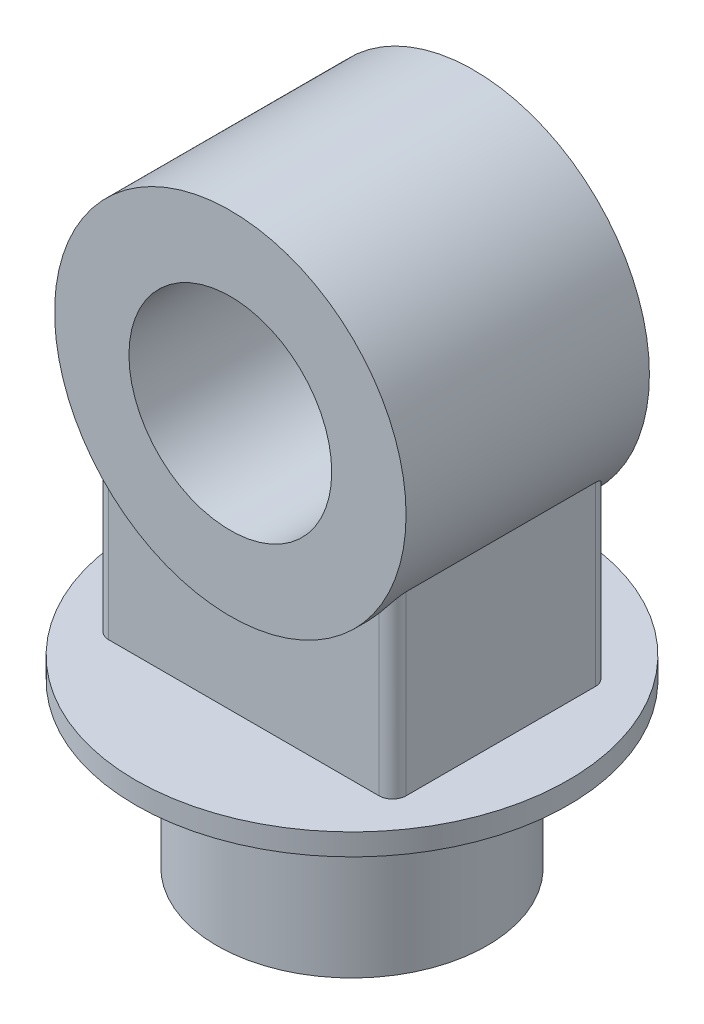
ISO-10303-21;
HEADER;
FILE_DESCRIPTION(('STEP AP214'),'2;1');
FILE_NAME('part.step','',(''),(''),'','','');
FILE_SCHEMA(('AUTOMOTIVE_DESIGN { 1 0 10303 214 1 1 1 1 }'));
ENDSEC;
DATA;
#1=APPLICATION_CONTEXT('core data for automotive mechanical design processes');
#2=APPLICATION_PROTOCOL_DEFINITION('international standard','automotive_design',2000,#1);
#3=PRODUCT_CONTEXT('',#1,'mechanical');
#4=PRODUCT('Part','Part','',(#3));
#5=PRODUCT_RELATED_PRODUCT_CATEGORY('part','',(#4));
#6=PRODUCT_DEFINITION_FORMATION('','',#4);
#7=PRODUCT_DEFINITION_CONTEXT('part definition',#1,'design');
#8=PRODUCT_DEFINITION('design','',#6,#7);
#9=PRODUCT_DEFINITION_SHAPE('','',#8);
#10=(LENGTH_UNIT() NAMED_UNIT(*) SI_UNIT(.MILLI.,.METRE.));
#11=(NAMED_UNIT(*) PLANE_ANGLE_UNIT() SI_UNIT($,.RADIAN.));
#12=(NAMED_UNIT(*) SI_UNIT($,.STERADIAN.) SOLID_ANGLE_UNIT());
#13=UNCERTAINTY_MEASURE_WITH_UNIT(LENGTH_MEASURE(1.E-05),#10,'distance_accuracy_value','');
#14=(GEOMETRIC_REPRESENTATION_CONTEXT(3) GLOBAL_UNCERTAINTY_ASSIGNED_CONTEXT((#13)) GLOBAL_UNIT_ASSIGNED_CONTEXT((#10,
#11,#12)) REPRESENTATION_CONTEXT('',''));
#15=CARTESIAN_POINT('',(0.,0.,0.));
#16=DIRECTION('',(0.,0.,1.));
#17=DIRECTION('',(1.,0.,0.));
#18=AXIS2_PLACEMENT_3D('',#15,#16,#17);
#19=CARTESIAN_POINT('',(0.,120.,0.));
#20=DIRECTION('',(0.,-1.,0.));
#21=DIRECTION('',(0.,0.,-1.));
#22=AXIS2_PLACEMENT_3D('',#19,#20,#21);
#23=CYLINDRICAL_SURFACE('',#22,100.);
#24=CARTESIAN_POINT('',(0.,120.,0.));
#25=DIRECTION('',(0.,1.,0.));
#26=DIRECTION('',(0.,0.,1.));
#27=AXIS2_PLACEMENT_3D('',#24,#25,#26);
#28=CIRCLE('',#27,100.);
#29=CARTESIAN_POINT('',(0.,120.,100.));
#30=VERTEX_POINT('',#29);
#31=EDGE_CURVE('E146',#30,#30,#28,.T.);
#32=ORIENTED_EDGE('',*,*,#31,.F.);
#33=EDGE_LOOP('',(#32));
#34=FACE_BOUND('',#33,.T.);
#35=CARTESIAN_POINT('',(0.,0.,0.));
#36=DIRECTION('',(0.,1.,0.));
#37=DIRECTION('',(0.,0.,1.));
#38=AXIS2_PLACEMENT_3D('',#35,#36,#37);
#39=CIRCLE('',#38,100.);
#40=CARTESIAN_POINT('',(0.,0.,100.));
#41=VERTEX_POINT('',#40);
#42=EDGE_CURVE('E240',#41,#41,#39,.T.);
#43=ORIENTED_EDGE('',*,*,#42,.T.);
#44=EDGE_LOOP('',(#43));
#45=FACE_BOUND('',#44,.T.);
#46=ADVANCED_FACE('F39',(#34,#45),#23,.T.);
#47=CARTESIAN_POINT('',(0.,0.,0.));
#48=DIRECTION('',(0.,1.,0.));
#49=DIRECTION('',(0.,0.,1.));
#50=AXIS2_PLACEMENT_3D('',#47,#48,#49);
#51=PLANE('',#50);
#52=ORIENTED_EDGE('',*,*,#42,.F.);
#53=EDGE_LOOP('',(#52));
#54=FACE_BOUND('',#53,.T.);
#55=ADVANCED_FACE('F251',(#54),#51,.F.);
#56=CARTESIAN_POINT('',(0.,136.,0.));
#57=DIRECTION('',(0.,-1.,0.));
#58=DIRECTION('',(0.,0.,-1.));
#59=AXIS2_PLACEMENT_3D('',#56,#57,#58);
#60=CYLINDRICAL_SURFACE('',#59,160.);
#61=CARTESIAN_POINT('',(0.,136.,0.));
#62=DIRECTION('',(0.,1.,0.));
#63=DIRECTION('',(0.,0.,1.));
#64=AXIS2_PLACEMENT_3D('',#61,#62,#63);
#65=CIRCLE('',#64,160.);
#66=CARTESIAN_POINT('',(0.,136.,160.));
#67=VERTEX_POINT('',#66);
#68=EDGE_CURVE('E236',#67,#67,#65,.T.);
#69=ORIENTED_EDGE('',*,*,#68,.F.);
#70=EDGE_LOOP('',(#69));
#71=FACE_BOUND('',#70,.T.);
#72=CARTESIAN_POINT('',(0.,120.,0.));
#73=DIRECTION('',(0.,1.,0.));
#74=DIRECTION('',(0.,0.,1.));
#75=AXIS2_PLACEMENT_3D('',#72,#73,#74);
#76=CIRCLE('',#75,160.);
#77=CARTESIAN_POINT('',(0.,120.,160.));
#78=VERTEX_POINT('',#77);
#79=EDGE_CURVE('E216',#78,#78,#76,.T.);
#80=ORIENTED_EDGE('',*,*,#79,.T.);
#81=EDGE_LOOP('',(#80));
#82=FACE_BOUND('',#81,.T.);
#83=ADVANCED_FACE('F253',(#71,#82),#60,.T.);
#84=CARTESIAN_POINT('',(0.,136.,0.));
#85=DIRECTION('',(0.,1.,0.));
#86=DIRECTION('',(0.,0.,1.));
#87=AXIS2_PLACEMENT_3D('',#84,#85,#86);
#88=PLANE('',#87);
#89=DIRECTION('',(0.,0.,-1.));
#90=VECTOR('',#89,1.);
#91=CARTESIAN_POINT('',(110.,136.,80.));
#92=LINE('',#91,#90);
#93=CARTESIAN_POINT('',(110.,136.,70.));
#94=VERTEX_POINT('',#93);
#95=CARTESIAN_POINT('',(110.,136.,-70.));
#96=VERTEX_POINT('',#95);
#97=EDGE_CURVE('E208',#94,#96,#92,.T.);
#98=ORIENTED_EDGE('',*,*,#97,.F.);
#99=CARTESIAN_POINT('',(100.,136.,70.));
#100=DIRECTION('',(0.,1.,0.));
#101=DIRECTION('',(0.,0.,1.));
#102=AXIS2_PLACEMENT_3D('',#99,#100,#101);
#103=CIRCLE('',#102,10.);
#104=CARTESIAN_POINT('',(100.,136.,80.));
#105=VERTEX_POINT('',#104);
#106=EDGE_CURVE('E123',#94,#105,#103,.F.);
#107=ORIENTED_EDGE('',*,*,#106,.T.);
#108=DIRECTION('',(1.,0.,0.));
#109=VECTOR('',#108,1.);
#110=CARTESIAN_POINT('',(-110.,136.,80.));
#111=LINE('',#110,#109);
#112=CARTESIAN_POINT('',(-100.,136.,80.));
#113=VERTEX_POINT('',#112);
#114=EDGE_CURVE('E231',#113,#105,#111,.T.);
#115=ORIENTED_EDGE('',*,*,#114,.F.);
#116=CARTESIAN_POINT('',(-100.,136.,70.));
#117=DIRECTION('',(0.,1.,0.));
#118=DIRECTION('',(0.,0.,1.));
#119=AXIS2_PLACEMENT_3D('',#116,#117,#118);
#120=CIRCLE('',#119,10.);
#121=CARTESIAN_POINT('',(-110.,136.,70.));
#122=VERTEX_POINT('',#121);
#123=EDGE_CURVE('E124',#113,#122,#120,.F.);
#124=ORIENTED_EDGE('',*,*,#123,.T.);
#125=DIRECTION('',(0.,0.,1.));
#126=VECTOR('',#125,1.);
#127=CARTESIAN_POINT('',(-110.,136.,80.));
#128=LINE('',#127,#126);
#129=CARTESIAN_POINT('',(-110.,136.,-70.));
#130=VERTEX_POINT('',#129);
#131=EDGE_CURVE('E393',#130,#122,#128,.T.);
#132=ORIENTED_EDGE('',*,*,#131,.F.);
#133=CARTESIAN_POINT('',(-100.,136.,-70.));
#134=DIRECTION('',(0.,1.,0.));
#135=DIRECTION('',(0.,0.,1.));
#136=AXIS2_PLACEMENT_3D('',#133,#134,#135);
#137=CIRCLE('',#136,10.);
#138=CARTESIAN_POINT('',(-100.,136.,-80.));
#139=VERTEX_POINT('',#138);
#140=EDGE_CURVE('E61',#130,#139,#137,.F.);
#141=ORIENTED_EDGE('',*,*,#140,.T.);
#142=DIRECTION('',(-1.,0.,0.));
#143=VECTOR('',#142,1.);
#144=CARTESIAN_POINT('',(-110.,136.,-80.));
#145=LINE('',#144,#143);
#146=CARTESIAN_POINT('',(100.,136.,-80.));
#147=VERTEX_POINT('',#146);
#148=EDGE_CURVE('E209',#147,#139,#145,.T.);
#149=ORIENTED_EDGE('',*,*,#148,.F.);
#150=CARTESIAN_POINT('',(100.,136.,-70.));
#151=DIRECTION('',(0.,1.,0.));
#152=DIRECTION('',(0.,0.,1.));
#153=AXIS2_PLACEMENT_3D('',#150,#151,#152);
#154=CIRCLE('',#153,10.);
#155=EDGE_CURVE('E54',#147,#96,#154,.F.);
#156=ORIENTED_EDGE('',*,*,#155,.T.);
#157=EDGE_LOOP('',(#98,#107,#115,#124,#132,#141,#149,#156));
#158=FACE_BOUND('',#157,.T.);
#159=ORIENTED_EDGE('',*,*,#68,.T.);
#160=EDGE_LOOP('',(#159));
#161=FACE_BOUND('',#160,.T.);
#162=ADVANCED_FACE('F206',(#158,#161),#88,.T.);
#163=CARTESIAN_POINT('',(0.,120.,0.));
#164=DIRECTION('',(0.,1.,0.));
#165=DIRECTION('',(0.,0.,1.));
#166=AXIS2_PLACEMENT_3D('',#163,#164,#165);
#167=PLANE('',#166);
#168=ORIENTED_EDGE('',*,*,#31,.T.);
#169=EDGE_LOOP('',(#168));
#170=FACE_BOUND('',#169,.T.);
#171=ORIENTED_EDGE('',*,*,#79,.F.);
#172=EDGE_LOOP('',(#171));
#173=FACE_BOUND('',#172,.T.);
#174=ADVANCED_FACE('F262',(#170,#173),#167,.F.);
#175=CARTESIAN_POINT('',(-110.,466.002,-80.));
#176=DIRECTION('',(0.,0.,1.));
#177=DIRECTION('',(1.,0.,0.));
#178=AXIS2_PLACEMENT_3D('',#175,#176,#177);
#179=PLANE('',#178);
#180=ORIENTED_EDGE('',*,*,#148,.T.);
#181=DIRECTION('',(0.,-1.,0.));
#182=VECTOR('',#181,1.);
#183=CARTESIAN_POINT('',(-100.,466.002,-80.));
#184=LINE('',#183,#182);
#185=CARTESIAN_POINT('',(-100.,252.933761370819,-80.));
#186=VERTEX_POINT('',#185);
#187=EDGE_CURVE('E162',#139,#186,#184,.F.);
#188=ORIENTED_EDGE('',*,*,#187,.T.);
#189=CARTESIAN_POINT('',(0.,336.,-80.));
#190=DIRECTION('',(0.,0.,1.));
#191=DIRECTION('',(1.,0.,0.));
#192=AXIS2_PLACEMENT_3D('',#189,#190,#191);
#193=CIRCLE('',#192,130.);
#194=CARTESIAN_POINT('',(100.,252.933761370819,-80.));
#195=VERTEX_POINT('',#194);
#196=EDGE_CURVE('E221',#195,#186,#193,.F.);
#197=ORIENTED_EDGE('',*,*,#196,.F.);
#198=DIRECTION('',(0.,-1.,0.));
#199=VECTOR('',#198,1.);
#200=CARTESIAN_POINT('',(100.,466.002,-80.));
#201=LINE('',#200,#199);
#202=EDGE_CURVE('E159',#195,#147,#201,.T.);
#203=ORIENTED_EDGE('',*,*,#202,.T.);
#204=EDGE_LOOP('',(#180,#188,#197,#203));
#205=FACE_BOUND('',#204,.T.);
#206=ADVANCED_FACE('F225',(#205),#179,.F.);
#207=CARTESIAN_POINT('',(110.,466.002,80.));
#208=DIRECTION('',(-1.,0.,0.));
#209=DIRECTION('',(0.,0.,1.));
#210=AXIS2_PLACEMENT_3D('',#207,#208,#209);
#211=PLANE('',#210);
#212=DIRECTION('',(0.,0.,-1.));
#213=VECTOR('',#212,1.);
#214=CARTESIAN_POINT('',(110.,266.717967697245,90.));
#215=LINE('',#214,#213);
#216=CARTESIAN_POINT('',(110.,266.717967697245,70.));
#217=VERTEX_POINT('',#216);
#218=CARTESIAN_POINT('',(110.,266.717967697245,-70.));
#219=VERTEX_POINT('',#218);
#220=EDGE_CURVE('E223',#217,#219,#215,.T.);
#221=ORIENTED_EDGE('',*,*,#220,.F.);
#222=DIRECTION('',(0.,-1.,0.));
#223=VECTOR('',#222,1.);
#224=CARTESIAN_POINT('',(110.,466.002,70.));
#225=LINE('',#224,#223);
#226=EDGE_CURVE('E155',#217,#94,#225,.T.);
#227=ORIENTED_EDGE('',*,*,#226,.T.);
#228=ORIENTED_EDGE('',*,*,#97,.T.);
#229=DIRECTION('',(0.,-1.,0.));
#230=VECTOR('',#229,1.);
#231=CARTESIAN_POINT('',(110.,466.002,-70.));
#232=LINE('',#231,#230);
#233=EDGE_CURVE('E152',#96,#219,#232,.F.);
#234=ORIENTED_EDGE('',*,*,#233,.T.);
#235=EDGE_LOOP('',(#221,#227,#228,#234));
#236=FACE_BOUND('',#235,.T.);
#237=ADVANCED_FACE('F212',(#236),#211,.F.);
#238=CARTESIAN_POINT('',(-110.,466.002,80.));
#239=DIRECTION('',(1.,0.,0.));
#240=DIRECTION('',(0.,0.,-1.));
#241=AXIS2_PLACEMENT_3D('',#238,#239,#240);
#242=PLANE('',#241);
#243=ORIENTED_EDGE('',*,*,#131,.T.);
#244=DIRECTION('',(0.,-1.,0.));
#245=VECTOR('',#244,1.);
#246=CARTESIAN_POINT('',(-110.,466.002,70.));
#247=LINE('',#246,#245);
#248=CARTESIAN_POINT('',(-110.,266.717967697245,70.));
#249=VERTEX_POINT('',#248);
#250=EDGE_CURVE('E144',#122,#249,#247,.F.);
#251=ORIENTED_EDGE('',*,*,#250,.T.);
#252=DIRECTION('',(0.,0.,-1.));
#253=VECTOR('',#252,1.);
#254=CARTESIAN_POINT('',(-110.,266.717967697245,90.));
#255=LINE('',#254,#253);
#256=CARTESIAN_POINT('',(-110.,266.717967697245,-70.));
#257=VERTEX_POINT('',#256);
#258=EDGE_CURVE('E118',#257,#249,#255,.F.);
#259=ORIENTED_EDGE('',*,*,#258,.F.);
#260=DIRECTION('',(0.,-1.,0.));
#261=VECTOR('',#260,1.);
#262=CARTESIAN_POINT('',(-110.,466.002,-70.));
#263=LINE('',#262,#261);
#264=EDGE_CURVE('E139',#257,#130,#263,.T.);
#265=ORIENTED_EDGE('',*,*,#264,.T.);
#266=EDGE_LOOP('',(#243,#251,#259,#265));
#267=FACE_BOUND('',#266,.T.);
#268=ADVANCED_FACE('F270',(#267),#242,.F.);
#269=CARTESIAN_POINT('',(-110.,466.002,80.));
#270=DIRECTION('',(0.,0.,-1.));
#271=DIRECTION('',(-1.,0.,0.));
#272=AXIS2_PLACEMENT_3D('',#269,#270,#271);
#273=PLANE('',#272);
#274=CARTESIAN_POINT('',(0.,336.,80.));
#275=DIRECTION('',(0.,0.,-1.));
#276=DIRECTION('',(-1.,0.,0.));
#277=AXIS2_PLACEMENT_3D('',#274,#275,#276);
#278=CIRCLE('',#277,130.);
#279=CARTESIAN_POINT('',(-100.,252.933761370819,80.));
#280=VERTEX_POINT('',#279);
#281=CARTESIAN_POINT('',(100.,252.933761370819,80.));
#282=VERTEX_POINT('',#281);
#283=EDGE_CURVE('E115',#280,#282,#278,.F.);
#284=ORIENTED_EDGE('',*,*,#283,.F.);
#285=DIRECTION('',(0.,-1.,0.));
#286=VECTOR('',#285,1.);
#287=CARTESIAN_POINT('',(-100.,466.002,80.));
#288=LINE('',#287,#286);
#289=EDGE_CURVE('E130',#280,#113,#288,.T.);
#290=ORIENTED_EDGE('',*,*,#289,.T.);
#291=ORIENTED_EDGE('',*,*,#114,.T.);
#292=DIRECTION('',(0.,-1.,0.));
#293=VECTOR('',#292,1.);
#294=CARTESIAN_POINT('',(100.,466.002,80.));
#295=LINE('',#294,#293);
#296=EDGE_CURVE('E133',#105,#282,#295,.F.);
#297=ORIENTED_EDGE('',*,*,#296,.T.);
#298=EDGE_LOOP('',(#284,#290,#291,#297));
#299=FACE_BOUND('',#298,.T.);
#300=ADVANCED_FACE('F128',(#299),#273,.F.);
#301=CARTESIAN_POINT('',(0.,336.,90.));
#302=DIRECTION('',(0.,0.,-1.));
#303=DIRECTION('',(-1.,0.,0.));
#304=AXIS2_PLACEMENT_3D('',#301,#302,#303);
#305=CYLINDRICAL_SURFACE('',#304,130.);
#306=CARTESIAN_POINT('',(0.,336.,90.));
#307=DIRECTION('',(0.,0.,1.));
#308=DIRECTION('',(1.,0.,0.));
#309=AXIS2_PLACEMENT_3D('',#306,#307,#308);
#310=CIRCLE('',#309,130.);
#311=CARTESIAN_POINT('',(130.,336.,90.));
#312=VERTEX_POINT('',#311);
#313=EDGE_CURVE('E135',#312,#312,#310,.T.);
#314=ORIENTED_EDGE('',*,*,#313,.F.);
#315=EDGE_LOOP('',(#314));
#316=FACE_BOUND('',#315,.T.);
#317=CARTESIAN_POINT('',(0.,336.,-90.));
#318=DIRECTION('',(0.,0.,1.));
#319=DIRECTION('',(1.,0.,0.));
#320=AXIS2_PLACEMENT_3D('',#317,#318,#319);
#321=CIRCLE('',#320,130.);
#322=CARTESIAN_POINT('',(130.,336.,-90.));
#323=VERTEX_POINT('',#322);
#324=EDGE_CURVE('E400',#323,#323,#321,.T.);
#325=ORIENTED_EDGE('',*,*,#324,.T.);
#326=EDGE_LOOP('',(#325));
#327=FACE_BOUND('',#326,.T.);
#328=ORIENTED_EDGE('',*,*,#283,.T.);
#329=CARTESIAN_POINT('',(100.,252.933761370819,80.));
#330=CARTESIAN_POINT('',(100.223611151915,253.202952503255,79.9999830665315));
#331=CARTESIAN_POINT('',(100.446118360057,253.473036166024,79.9924995885085));
#332=CARTESIAN_POINT('',(100.888548742496,254.014496760122,79.9629173131463));
#333=CARTESIAN_POINT('',(101.108472043759,254.285873626978,79.9408192370116));
#334=CARTESIAN_POINT('',(101.545586290072,254.829711400373,79.8822979337703));
#335=CARTESIAN_POINT('',(101.76277446753,255.102173087004,79.8458612385231));
#336=CARTESIAN_POINT('',(102.193849033468,255.647413797012,79.7588609087488));
#337=CARTESIAN_POINT('',(102.407735374993,255.920192824843,79.7082970735217));
#338=CARTESIAN_POINT('',(103.048408055095,256.74400885936,79.5343891784366));
#339=CARTESIAN_POINT('',(103.469748368072,257.294974230618,79.3894263280958));
#340=CARTESIAN_POINT('',(104.088382224678,258.117224843771,79.1288060997198));
#341=CARTESIAN_POINT('',(104.292337034927,258.39057162742,79.0347525474725));
#342=CARTESIAN_POINT('',(104.695498702643,258.935304765081,78.8319429710982));
#343=CARTESIAN_POINT('',(104.894706004332,259.206691300842,78.7231883289499));
#344=CARTESIAN_POINT('',(105.336170271764,259.812965668139,78.4620472638272));
#345=CARTESIAN_POINT('',(105.577006541077,260.147108038148,78.3055009036513));
#346=CARTESIAN_POINT('',(106.04966094987,260.809343252621,77.967808626391));
#347=CARTESIAN_POINT('',(106.281479043935,261.137436066616,77.7866625854443));
#348=CARTESIAN_POINT('',(106.734152264033,261.784259610706,77.3986376161628));
#349=CARTESIAN_POINT('',(106.955036134368,262.103013877598,77.1918317878757));
#350=CARTESIAN_POINT('',(107.384708325122,262.728803605627,76.749894392022));
#351=CARTESIAN_POINT('',(107.593501627276,263.035843875289,76.5147746155492));
#352=CARTESIAN_POINT('',(107.921279015409,263.522080966666,76.1068757916445));
#353=CARTESIAN_POINT('',(108.044709884718,263.706240813682,75.9435605188262));
#354=CARTESIAN_POINT('',(108.284949666933,264.066582834907,75.6038296157538));
#355=CARTESIAN_POINT('',(108.401760304956,264.242767084986,75.4274174262628));
#356=CARTESIAN_POINT('',(108.627683741988,264.585236991633,75.0605773993746));
#357=CARTESIAN_POINT('',(108.736797961361,264.751524473746,74.8701521613912));
#358=CARTESIAN_POINT('',(108.945874410432,265.071634412635,74.4745306992528));
#359=CARTESIAN_POINT('',(109.04583974995,265.225461102935,74.2693395369045));
#360=CARTESIAN_POINT('',(109.274660386151,265.579056080623,73.7536743100227));
#361=CARTESIAN_POINT('',(109.398046362816,265.771031349643,73.4351396850742));
#362=CARTESIAN_POINT('',(109.561336457207,266.026263049992,72.9345418523036));
#363=CARTESIAN_POINT('',(109.612072269395,266.105785634321,72.7641622498837));
#364=CARTESIAN_POINT('',(109.705421847597,266.25239837099,72.4160328323223));
#365=CARTESIAN_POINT('',(109.748040656091,266.319496241142,72.2382876769633));
#366=CARTESIAN_POINT('',(109.820262744001,266.433384610412,71.8947331689276));
#367=CARTESIAN_POINT('',(109.850752312767,266.481551609067,71.729567610939));
#368=CARTESIAN_POINT('',(109.903691363628,266.565274678988,71.3948451418076));
#369=CARTESIAN_POINT('',(109.926143541964,266.600834979285,71.2252897238033));
#370=CARTESIAN_POINT('',(109.962659042777,266.658707696818,70.8807814271977));
#371=CARTESIAN_POINT('',(109.976613864032,266.680848750137,70.7057875562757));
#372=CARTESIAN_POINT('',(109.99061964662,266.703076138542,70.4419386674803));
#373=CARTESIAN_POINT('',(109.99413386492,266.708654625171,70.3536902139711));
#374=CARTESIAN_POINT('',(109.998824989492,266.716102079045,70.1769662160102));
#375=CARTESIAN_POINT('',(110.000001659485,266.717970671296,70.088490649507));
#376=CARTESIAN_POINT('',(110.,266.717967697245,70.));
#377=B_SPLINE_CURVE_WITH_KNOTS('',3,(#329,#330,#331,#332,#333,#334,#335,#336,#337,#338,#339,
#340,#341,#342,#343,#344,#345,#346,#347,#348,#349,#350,#351,#352,#353,#354,#355,#356,#357,#358,
#359,#360,#361,#362,#363,#364,#365,#366,#367,#368,#369,#370,#371,#372,#373,#374,#375,#376),
.UNSPECIFIED.,.F.,.F.,(4,2,2,2,2,2,2,2,2,2,2,2,2,2,2,2,2,2,2,2,2,2,2,4),(0.,1.04974156507773,
2.09943133114569,3.15010942417266,4.20080244462031,6.32356278933855,7.38465211465322,
8.44564176134494,9.76677685539393,11.0879186017609,12.4053795382949,13.7222937149077,
14.5479419827464,15.3733741023698,16.1986534888326,17.0236513022889,18.194686650492,
18.7783719827904,19.3616935243415,19.8852298594992,20.408590403038,20.9385006934629,
21.2038887699912,21.4693036704869),.UNSPECIFIED.);
#378=EDGE_CURVE('E188',#282,#217,#377,.T.);
#379=ORIENTED_EDGE('',*,*,#378,.T.);
#380=ORIENTED_EDGE('',*,*,#220,.T.);
#381=CARTESIAN_POINT('',(110.,266.717967697245,-70.));
#382=CARTESIAN_POINT('',(110.000033683462,266.718025852698,-70.1614230595313));
#383=CARTESIAN_POINT('',(109.996092792414,266.711764254296,-70.3228118197691));
#384=CARTESIAN_POINT('',(109.980519982779,266.687045880384,-70.6441123999957));
#385=CARTESIAN_POINT('',(109.968896213713,266.668602027069,-70.8040256031146));
#386=CARTESIAN_POINT('',(109.938376398954,266.620217986395,-71.1196424551221));
#387=CARTESIAN_POINT('',(109.919558261622,266.590400967593,-71.2753727040436));
#388=CARTESIAN_POINT('',(109.875071558334,266.52000006118,-71.5834085562726));
#389=CARTESIAN_POINT('',(109.849400846184,266.479412800404,-71.7357130704249));
#390=CARTESIAN_POINT('',(109.784772267017,266.377386983169,-72.0722520040974));
#391=CARTESIAN_POINT('',(109.744103525393,266.313281105856,-72.2553511890568));
#392=CARTESIAN_POINT('',(109.654040532803,266.17165023193,-72.6141464391851));
#393=CARTESIAN_POINT('',(109.604640075501,266.094115691273,-72.7898371277865));
#394=CARTESIAN_POINT('',(109.497968805892,265.927147418338,-73.1338723913451));
#395=CARTESIAN_POINT('',(109.440667457039,265.837667562915,-73.3021849515411));
#396=CARTESIAN_POINT('',(109.319341126161,265.648779195145,-73.6304969218558));
#397=CARTESIAN_POINT('',(109.25531768694,265.549372961282,-73.7904982269664));
#398=CARTESIAN_POINT('',(109.085069343255,265.28590129292,-74.1868876463209));
#399=CARTESIAN_POINT('',(108.974781990569,265.115997241409,-74.4176642111939));
#400=CARTESIAN_POINT('',(108.742772943656,264.76058359918,-74.8607110351426));
#401=CARTESIAN_POINT('',(108.621044869784,264.575065307649,-75.072970840064));
#402=CARTESIAN_POINT('',(108.36794946479,264.19164129378,-75.4804206329535));
#403=CARTESIAN_POINT('',(108.236568322626,263.993717884812,-75.6755852518652));
#404=CARTESIAN_POINT('',(107.965814499919,263.588382733387,-76.0497203250662));
#405=CARTESIAN_POINT('',(107.826442440892,263.380971729107,-76.2286920360201));
#406=CARTESIAN_POINT('',(107.56145650763,262.989174407744,-76.5468161797372));
#407=CARTESIAN_POINT('',(107.436764821801,262.805791987749,-76.6879854690674));
#408=CARTESIAN_POINT('',(107.182869679799,262.434497987953,-76.9599552926783));
#409=CARTESIAN_POINT('',(107.053665586411,262.24658576965,-77.0907543539386));
#410=CARTESIAN_POINT('',(106.659844344167,261.677121003612,-77.4685356621902));
#411=CARTESIAN_POINT('',(106.389102445143,261.289965080353,-77.7008024816961));
#412=CARTESIAN_POINT('',(105.833418194947,260.504836154638,-78.129863631631));
#413=CARTESIAN_POINT('',(105.548442441802,260.106838810795,-78.3265689888296));
#414=CARTESIAN_POINT('',(104.96676628824,259.304344779382,-78.6860846955172));
#415=CARTESIAN_POINT('',(104.670068038633,258.899849292081,-78.8489012287858));
#416=CARTESIAN_POINT('',(104.024574509401,258.030646711215,-79.1623550419402));
#417=CARTESIAN_POINT('',(103.674248758637,257.565348460988,-79.3081944572228));
#418=CARTESIAN_POINT('',(102.961876677953,256.632523338709,-79.558756520093));
#419=CARTESIAN_POINT('',(102.599828734006,256.16499616738,-79.6634734792563));
#420=CARTESIAN_POINT('',(102.051092736822,255.466397204689,-79.7891645729388));
#421=CARTESIAN_POINT('',(101.868137468165,255.235094848973,-79.8257282191265));
#422=CARTESIAN_POINT('',(101.499966150616,254.77288550036,-79.8886289353229));
#423=CARTESIAN_POINT('',(101.314750133026,254.541978502041,-79.9149661467555));
#424=CARTESIAN_POINT('',(100.942320486513,254.080919722901,-79.9572665465167));
#425=CARTESIAN_POINT('',(100.755107350153,253.850767773367,-79.9732322353467));
#426=CARTESIAN_POINT('',(100.378860262163,253.391449185777,-79.9945948234744));
#427=CARTESIAN_POINT('',(100.189826234412,253.162282589497,-79.9999912789888));
#428=CARTESIAN_POINT('',(100.,252.933761370819,-80.));
#429=B_SPLINE_CURVE_WITH_KNOTS('',3,(#381,#382,#383,#384,#385,#386,#387,#388,#389,#390,#391,
#392,#393,#394,#395,#396,#397,#398,#399,#400,#401,#402,#403,#404,#405,#406,#407,#408,#409,#410,
#411,#412,#413,#414,#415,#416,#417,#418,#419,#420,#421,#422,#423,#424,#425,#426,#427,#428),
.UNSPECIFIED.,.F.,.F.,(4,2,2,2,2,2,2,2,2,2,2,2,2,2,2,2,2,2,2,2,2,2,2,4),(0.,0.48404500592307,
0.967577389145413,1.44601544684507,1.92460352520314,2.51835043890469,3.11252108624077,
3.70905613988741,4.30545457926274,5.22516595363373,6.14539326092327,7.06696382284195,
7.98846280401968,8.77680092000546,9.56525081419898,11.1426900482287,12.7240229357799,
14.3050670200471,16.1047501551829,17.9046821508918,18.7960435003637,19.6873925225409,
20.5785265668947,21.4696980275819),.UNSPECIFIED.);
#430=EDGE_CURVE('E11',#219,#195,#429,.T.);
#431=ORIENTED_EDGE('',*,*,#430,.T.);
#432=ORIENTED_EDGE('',*,*,#196,.T.);
#433=CARTESIAN_POINT('',(-100.,252.933761370819,-80.));
#434=CARTESIAN_POINT('',(-100.223611151915,253.202952503255,-79.9999830665315));
#435=CARTESIAN_POINT('',(-100.446118360057,253.473036166024,-79.9924995885085));
#436=CARTESIAN_POINT('',(-100.888548742496,254.014496760122,-79.9629173131463));
#437=CARTESIAN_POINT('',(-101.108472043759,254.285873626978,-79.9408192370116));
#438=CARTESIAN_POINT('',(-101.545586290072,254.829711400373,-79.8822979337703));
#439=CARTESIAN_POINT('',(-101.76277446753,255.102173087004,-79.8458612385231));
#440=CARTESIAN_POINT('',(-102.193849033468,255.647413797012,-79.7588609087488));
#441=CARTESIAN_POINT('',(-102.407735374993,255.920192824843,-79.7082970735217));
#442=CARTESIAN_POINT('',(-103.048408055095,256.74400885936,-79.5343891784366));
#443=CARTESIAN_POINT('',(-103.469748368072,257.294974230618,-79.3894263280958));
#444=CARTESIAN_POINT('',(-104.088382224678,258.117224843771,-79.1288060997198));
#445=CARTESIAN_POINT('',(-104.292337034927,258.39057162742,-79.0347525474725));
#446=CARTESIAN_POINT('',(-104.695498702643,258.935304765081,-78.8319429710982));
#447=CARTESIAN_POINT('',(-104.894706004332,259.206691300842,-78.7231883289499));
#448=CARTESIAN_POINT('',(-105.336170271764,259.812965668139,-78.4620472638272));
#449=CARTESIAN_POINT('',(-105.577006541077,260.147108038148,-78.3055009036513));
#450=CARTESIAN_POINT('',(-106.049660949871,260.809343252621,-77.967808626391));
#451=CARTESIAN_POINT('',(-106.281479043935,261.137436066616,-77.7866625854443));
#452=CARTESIAN_POINT('',(-106.734152264033,261.784259610706,-77.3986376161628));
#453=CARTESIAN_POINT('',(-106.955036134368,262.103013877598,-77.1918317878757));
#454=CARTESIAN_POINT('',(-107.384708325122,262.728803605627,-76.749894392022));
#455=CARTESIAN_POINT('',(-107.593501627276,263.035843875289,-76.5147746155492));
#456=CARTESIAN_POINT('',(-107.921279015409,263.522080966666,-76.1068757916446));
#457=CARTESIAN_POINT('',(-108.044709884718,263.706240813682,-75.9435605188263));
#458=CARTESIAN_POINT('',(-108.284949666933,264.066582834907,-75.6038296157538));
#459=CARTESIAN_POINT('',(-108.401760304956,264.242767084986,-75.4274174262628));
#460=CARTESIAN_POINT('',(-108.627683741988,264.585236991633,-75.0605773993746));
#461=CARTESIAN_POINT('',(-108.736797961361,264.751524473746,-74.8701521613912));
#462=CARTESIAN_POINT('',(-108.945874410432,265.071634412635,-74.4745306992528));
#463=CARTESIAN_POINT('',(-109.04583974995,265.225461102935,-74.2693395369045));
#464=CARTESIAN_POINT('',(-109.274660386151,265.579056080623,-73.7536743100227));
#465=CARTESIAN_POINT('',(-109.398046362816,265.771031349643,-73.4351396850742));
#466=CARTESIAN_POINT('',(-109.561336457207,266.026263049992,-72.9345418523035));
#467=CARTESIAN_POINT('',(-109.612072269395,266.105785634321,-72.7641622498837));
#468=CARTESIAN_POINT('',(-109.705421847597,266.25239837099,-72.4160328323222));
#469=CARTESIAN_POINT('',(-109.748040656091,266.319496241142,-72.2382876769632));
#470=CARTESIAN_POINT('',(-109.820262744001,266.433384610412,-71.8947331689276));
#471=CARTESIAN_POINT('',(-109.850752312767,266.481551609067,-71.729567610939));
#472=CARTESIAN_POINT('',(-109.903691363628,266.565274678987,-71.3948451418076));
#473=CARTESIAN_POINT('',(-109.926143541964,266.600834979285,-71.2252897238033));
#474=CARTESIAN_POINT('',(-109.962659042777,266.658707696818,-70.8807814271977));
#475=CARTESIAN_POINT('',(-109.976613864032,266.680848750137,-70.7057875562757));
#476=CARTESIAN_POINT('',(-109.99061964662,266.703076138542,-70.4419386674803));
#477=CARTESIAN_POINT('',(-109.99413386492,266.708654625171,-70.3536902139711));
#478=CARTESIAN_POINT('',(-109.998824989492,266.716102079045,-70.1769662160103));
#479=CARTESIAN_POINT('',(-110.000001659485,266.717970671296,-70.088490649507));
#480=CARTESIAN_POINT('',(-110.,266.717967697245,-70.));
#481=B_SPLINE_CURVE_WITH_KNOTS('',3,(#433,#434,#435,#436,#437,#438,#439,#440,#441,#442,#443,
#444,#445,#446,#447,#448,#449,#450,#451,#452,#453,#454,#455,#456,#457,#458,#459,#460,#461,#462,
#463,#464,#465,#466,#467,#468,#469,#470,#471,#472,#473,#474,#475,#476,#477,#478,#479,#480),
.UNSPECIFIED.,.F.,.F.,(4,2,2,2,2,2,2,2,2,2,2,2,2,2,2,2,2,2,2,2,2,2,2,4),(0.,1.04974156507773,
2.0994313311457,3.15010942417266,4.20080244462032,6.32356278933856,7.38465211465323,
8.44564176134495,9.76677685539396,11.087918601761,12.4053795382949,13.7222937149077,
14.5479419827463,15.3733741023698,16.1986534888326,17.023651302289,18.194686650492,
18.7783719827905,19.3616935243415,19.8852298594992,20.408590403038,20.9385006934629,
21.2038887699912,21.4693036704869),.UNSPECIFIED.);
#482=EDGE_CURVE('E197',#186,#257,#481,.T.);
#483=ORIENTED_EDGE('',*,*,#482,.T.);
#484=ORIENTED_EDGE('',*,*,#258,.T.);
#485=CARTESIAN_POINT('',(-110.,266.717967697245,70.));
#486=CARTESIAN_POINT('',(-110.000033683462,266.718025852698,70.1614230595313));
#487=CARTESIAN_POINT('',(-109.996092792414,266.711764254296,70.3228118197691));
#488=CARTESIAN_POINT('',(-109.980519982779,266.687045880384,70.6441123999957));
#489=CARTESIAN_POINT('',(-109.968896213713,266.668602027069,70.8040256031146));
#490=CARTESIAN_POINT('',(-109.938376398954,266.620217986395,71.1196424551221));
#491=CARTESIAN_POINT('',(-109.919558261622,266.590400967593,71.2753727040436));
#492=CARTESIAN_POINT('',(-109.875071558334,266.52000006118,71.5834085562726));
#493=CARTESIAN_POINT('',(-109.849400846184,266.479412800404,71.7357130704249));
#494=CARTESIAN_POINT('',(-109.784772267017,266.377386983169,72.0722520040974));
#495=CARTESIAN_POINT('',(-109.744103525393,266.313281105855,72.2553511890568));
#496=CARTESIAN_POINT('',(-109.654040532803,266.171650231929,72.6141464391851));
#497=CARTESIAN_POINT('',(-109.604640075501,266.094115691273,72.7898371277865));
#498=CARTESIAN_POINT('',(-109.497968805892,265.927147418338,73.133872391345));
#499=CARTESIAN_POINT('',(-109.440667457039,265.837667562915,73.302184951541));
#500=CARTESIAN_POINT('',(-109.319341126161,265.648779195145,73.6304969218558));
#501=CARTESIAN_POINT('',(-109.25531768694,265.549372961282,73.7904982269664));
#502=CARTESIAN_POINT('',(-109.085069343255,265.28590129292,74.1868876463209));
#503=CARTESIAN_POINT('',(-108.974781990569,265.115997241409,74.4176642111939));
#504=CARTESIAN_POINT('',(-108.742772943656,264.76058359918,74.8607110351426));
#505=CARTESIAN_POINT('',(-108.621044869784,264.575065307649,75.072970840064));
#506=CARTESIAN_POINT('',(-108.36794946479,264.19164129378,75.4804206329535));
#507=CARTESIAN_POINT('',(-108.236568322626,263.993717884812,75.6755852518652));
#508=CARTESIAN_POINT('',(-107.965814499919,263.588382733387,76.0497203250662));
#509=CARTESIAN_POINT('',(-107.826442440892,263.380971729107,76.2286920360201));
#510=CARTESIAN_POINT('',(-107.56145650763,262.989174407744,76.5468161797372));
#511=CARTESIAN_POINT('',(-107.436764821801,262.805791987749,76.6879854690674));
#512=CARTESIAN_POINT('',(-107.182869679799,262.434497987953,76.9599552926783));
#513=CARTESIAN_POINT('',(-107.053665586411,262.24658576965,77.0907543539386));
#514=CARTESIAN_POINT('',(-106.659844344167,261.677121003612,77.4685356621902));
#515=CARTESIAN_POINT('',(-106.389102445143,261.289965080353,77.7008024816961));
#516=CARTESIAN_POINT('',(-105.833418194947,260.504836154638,78.129863631631));
#517=CARTESIAN_POINT('',(-105.548442441802,260.106838810795,78.3265689888296));
#518=CARTESIAN_POINT('',(-104.96676628824,259.304344779382,78.6860846955171));
#519=CARTESIAN_POINT('',(-104.670068038633,258.899849292081,78.8489012287858));
#520=CARTESIAN_POINT('',(-104.024574509401,258.030646711215,79.1623550419402));
#521=CARTESIAN_POINT('',(-103.674248758637,257.565348460988,79.3081944572228));
#522=CARTESIAN_POINT('',(-102.961876677953,256.632523338709,79.558756520093));
#523=CARTESIAN_POINT('',(-102.599828734006,256.16499616738,79.6634734792563));
#524=CARTESIAN_POINT('',(-102.051092736822,255.466397204689,79.7891645729387));
#525=CARTESIAN_POINT('',(-101.868137468165,255.235094848973,79.8257282191264));
#526=CARTESIAN_POINT('',(-101.499966150616,254.77288550036,79.8886289353229));
#527=CARTESIAN_POINT('',(-101.314750133026,254.541978502041,79.9149661467555));
#528=CARTESIAN_POINT('',(-100.942320486513,254.080919722901,79.9572665465168));
#529=CARTESIAN_POINT('',(-100.755107350153,253.850767773367,79.9732322353467));
#530=CARTESIAN_POINT('',(-100.378860262163,253.391449185777,79.9945948234744));
#531=CARTESIAN_POINT('',(-100.189826234412,253.162282589497,79.9999912789888));
#532=CARTESIAN_POINT('',(-100.,252.933761370819,80.));
#533=B_SPLINE_CURVE_WITH_KNOTS('',3,(#485,#486,#487,#488,#489,#490,#491,#492,#493,#494,#495,
#496,#497,#498,#499,#500,#501,#502,#503,#504,#505,#506,#507,#508,#509,#510,#511,#512,#513,#514,
#515,#516,#517,#518,#519,#520,#521,#522,#523,#524,#525,#526,#527,#528,#529,#530,#531,#532),
.UNSPECIFIED.,.F.,.F.,(4,2,2,2,2,2,2,2,2,2,2,2,2,2,2,2,2,2,2,2,2,2,2,4),(0.,0.48404500592307,
0.967577389145426,1.44601544684509,1.92460352520314,2.51835043890468,3.11252108624076,
3.70905613988741,4.30545457926273,5.22516595363371,6.14539326092325,7.06696382284192,
7.98846280401966,8.77680092000544,9.56525081419903,11.1426900482287,12.7240229357798,
14.305067020047,16.1047501551829,17.9046821508917,18.7960435003638,19.687392522541,
20.5785265668948,21.4696980275819),.UNSPECIFIED.);
#534=EDGE_CURVE('E112',#249,#280,#533,.T.);
#535=ORIENTED_EDGE('',*,*,#534,.T.);
#536=EDGE_LOOP('',(#328,#379,#380,#431,#432,#483,#484,#535));
#537=FACE_BOUND('',#536,.T.);
#538=ADVANCED_FACE('F114',(#316,#327,#537),#305,.T.);
#539=CARTESIAN_POINT('',(0.,336.,90.));
#540=DIRECTION('',(0.,0.,1.));
#541=DIRECTION('',(1.,0.,0.));
#542=AXIS2_PLACEMENT_3D('',#539,#540,#541);
#543=PLANE('',#542);
#544=ORIENTED_EDGE('',*,*,#313,.T.);
#545=EDGE_LOOP('',(#544));
#546=FACE_BOUND('',#545,.T.);
#547=CARTESIAN_POINT('',(0.,336.,90.));
#548=DIRECTION('',(0.,0.,1.));
#549=DIRECTION('',(1.,0.,0.));
#550=AXIS2_PLACEMENT_3D('',#547,#548,#549);
#551=CIRCLE('',#550,75.);
#552=CARTESIAN_POINT('',(-75.,336.,90.));
#553=VERTEX_POINT('',#552);
#554=EDGE_CURVE('E404',#553,#553,#551,.T.);
#555=ORIENTED_EDGE('',*,*,#554,.F.);
#556=EDGE_LOOP('',(#555));
#557=FACE_BOUND('',#556,.T.);
#558=ADVANCED_FACE('F299',(#546,#557),#543,.T.);
#559=CARTESIAN_POINT('',(0.,336.,-90.));
#560=DIRECTION('',(0.,0.,1.));
#561=DIRECTION('',(1.,0.,0.));
#562=AXIS2_PLACEMENT_3D('',#559,#560,#561);
#563=PLANE('',#562);
#564=ORIENTED_EDGE('',*,*,#324,.F.);
#565=EDGE_LOOP('',(#564));
#566=FACE_BOUND('',#565,.T.);
#567=CARTESIAN_POINT('',(0.,336.,-90.));
#568=DIRECTION('',(0.,0.,1.));
#569=DIRECTION('',(1.,0.,0.));
#570=AXIS2_PLACEMENT_3D('',#567,#568,#569);
#571=CIRCLE('',#570,75.);
#572=CARTESIAN_POINT('',(-75.,336.,-90.));
#573=VERTEX_POINT('',#572);
#574=EDGE_CURVE('E408',#573,#573,#571,.T.);
#575=ORIENTED_EDGE('',*,*,#574,.T.);
#576=EDGE_LOOP('',(#575));
#577=FACE_BOUND('',#576,.T.);
#578=ADVANCED_FACE('F307',(#566,#577),#563,.F.);
#579=CARTESIAN_POINT('',(0.,336.,90.));
#580=DIRECTION('',(0.,0.,-1.));
#581=DIRECTION('',(-1.,0.,0.));
#582=AXIS2_PLACEMENT_3D('',#579,#580,#581);
#583=CYLINDRICAL_SURFACE('',#582,75.);
#584=CARTESIAN_POINT('',(-75.,336.,90.));
#585=CARTESIAN_POINT('',(-75.,336.,88.125));
#586=CARTESIAN_POINT('',(-75.,336.,86.25));
#587=CARTESIAN_POINT('',(-75.,336.,82.5));
#588=CARTESIAN_POINT('',(-75.,336.,80.625));
#589=CARTESIAN_POINT('',(-75.,336.,76.875));
#590=CARTESIAN_POINT('',(-75.,336.,75.));
#591=CARTESIAN_POINT('',(-75.,336.,71.25));
#592=CARTESIAN_POINT('',(-75.,336.,69.375));
#593=CARTESIAN_POINT('',(-75.,336.,65.625));
#594=CARTESIAN_POINT('',(-75.,336.,63.75));
#595=CARTESIAN_POINT('',(-75.,336.,60.));
#596=CARTESIAN_POINT('',(-75.,336.,58.125));
#597=CARTESIAN_POINT('',(-75.,336.,54.375));
#598=CARTESIAN_POINT('',(-75.,336.,52.5));
#599=CARTESIAN_POINT('',(-75.,336.,48.75));
#600=CARTESIAN_POINT('',(-75.,336.,46.875));
#601=CARTESIAN_POINT('',(-75.,336.,43.125));
#602=CARTESIAN_POINT('',(-75.,336.,41.25));
#603=CARTESIAN_POINT('',(-75.,336.,37.5));
#604=CARTESIAN_POINT('',(-75.,336.,35.625));
#605=CARTESIAN_POINT('',(-75.,336.,31.875));
#606=CARTESIAN_POINT('',(-75.,336.,30.));
#607=CARTESIAN_POINT('',(-75.,336.,26.25));
#608=CARTESIAN_POINT('',(-75.,336.,24.375));
#609=CARTESIAN_POINT('',(-75.,336.,20.625));
#610=CARTESIAN_POINT('',(-75.,336.,18.75));
#611=CARTESIAN_POINT('',(-75.,336.,15.));
#612=CARTESIAN_POINT('',(-75.,336.,13.125));
#613=CARTESIAN_POINT('',(-75.,336.,9.37499999999998));
#614=CARTESIAN_POINT('',(-75.,336.,7.49999999999998));
#615=CARTESIAN_POINT('',(-75.,336.,3.74999999999998));
#616=CARTESIAN_POINT('',(-75.,336.,1.87499999999997));
#617=CARTESIAN_POINT('',(-75.,336.,-1.87500000000003));
#618=CARTESIAN_POINT('',(-75.,336.,-3.75000000000003));
#619=CARTESIAN_POINT('',(-75.,336.,-7.50000000000003));
#620=CARTESIAN_POINT('',(-75.,336.,-9.37500000000004));
#621=CARTESIAN_POINT('',(-75.,336.,-13.125));
#622=CARTESIAN_POINT('',(-75.,336.,-15.));
#623=CARTESIAN_POINT('',(-75.,336.,-18.75));
#624=CARTESIAN_POINT('',(-75.,336.,-20.625));
#625=CARTESIAN_POINT('',(-75.,336.,-24.375));
#626=CARTESIAN_POINT('',(-75.,336.,-26.25));
#627=CARTESIAN_POINT('',(-75.,336.,-30.));
#628=CARTESIAN_POINT('',(-75.,336.,-31.875));
#629=CARTESIAN_POINT('',(-75.,336.,-35.625));
#630=CARTESIAN_POINT('',(-75.,336.,-37.5));
#631=CARTESIAN_POINT('',(-75.,336.,-41.25));
#632=CARTESIAN_POINT('',(-75.,336.,-43.125));
#633=CARTESIAN_POINT('',(-75.,336.,-46.875));
#634=CARTESIAN_POINT('',(-75.,336.,-48.75));
#635=CARTESIAN_POINT('',(-75.,336.,-52.5));
#636=CARTESIAN_POINT('',(-75.,336.,-54.375));
#637=CARTESIAN_POINT('',(-75.,336.,-58.125));
#638=CARTESIAN_POINT('',(-75.,336.,-60.));
#639=CARTESIAN_POINT('',(-75.,336.,-63.75));
#640=CARTESIAN_POINT('',(-75.,336.,-65.625));
#641=CARTESIAN_POINT('',(-75.,336.,-69.375));
#642=CARTESIAN_POINT('',(-75.,336.,-71.25));
#643=CARTESIAN_POINT('',(-75.,336.,-75.));
#644=CARTESIAN_POINT('',(-75.,336.,-76.875));
#645=CARTESIAN_POINT('',(-75.,336.,-80.625));
#646=CARTESIAN_POINT('',(-75.,336.,-82.5));
#647=CARTESIAN_POINT('',(-75.,336.,-86.25));
#648=CARTESIAN_POINT('',(-75.,336.,-88.125));
#649=CARTESIAN_POINT('',(-75.,336.,-90.));
#650=B_SPLINE_CURVE_WITH_KNOTS('',3,(#584,#585,#586,#587,#588,#589,#590,#591,#592,#593,#594,
#595,#596,#597,#598,#599,#600,#601,#602,#603,#604,#605,#606,#607,#608,#609,#610,#611,#612,#613,
#614,#615,#616,#617,#618,#619,#620,#621,#622,#623,#624,#625,#626,#627,#628,#629,#630,#631,#632,
#633,#634,#635,#636,#637,#638,#639,#640,#641,#642,#643,#644,#645,#646,#647,#648,#649),
.UNSPECIFIED.,.F.,.F.,(4,2,2,2,2,2,2,2,2,2,2,2,2,2,2,2,2,2,2,2,2,2,2,2,2,2,2,2,2,2,2,2,4),(0.,
5.62499999999999,11.25,16.875,22.5,28.125,33.75,39.375,45.,50.625,56.25,61.875,67.5,73.125,
78.75,84.375,90.,95.625,101.25,106.875,112.5,118.125,123.75,129.375,135.,140.625,146.25,151.875,
157.5,163.125,168.75,174.375,180.),.UNSPECIFIED.);
#651=EDGE_CURVE('BSEAM181',#553,#573,#650,.T.);
#652=ORIENTED_EDGE('',*,*,#554,.T.);
#653=ORIENTED_EDGE('',*,*,#574,.F.);
#654=ORIENTED_EDGE('',*,*,#651,.T.);
#655=ORIENTED_EDGE('',*,*,#651,.F.);
#656=EDGE_LOOP('',(#652,#654,#653,#655));
#657=FACE_BOUND('',#656,.T.);
#658=ADVANCED_FACE('F181',(#657),#583,.F.);
#659=CARTESIAN_POINT('',(-100.,466.002,70.));
#660=DIRECTION('',(0.,-1.,0.));
#661=DIRECTION('',(0.,0.,-1.));
#662=AXIS2_PLACEMENT_3D('',#659,#660,#661);
#663=CYLINDRICAL_SURFACE('',#662,10.);
#664=ORIENTED_EDGE('',*,*,#534,.F.);
#665=ORIENTED_EDGE('',*,*,#250,.F.);
#666=ORIENTED_EDGE('',*,*,#123,.F.);
#667=ORIENTED_EDGE('',*,*,#289,.F.);
#668=EDGE_LOOP('',(#664,#665,#666,#667));
#669=FACE_BOUND('',#668,.T.);
#670=ADVANCED_FACE('F137',(#669),#663,.T.);
#671=CARTESIAN_POINT('',(100.,466.002,70.));
#672=DIRECTION('',(0.,-1.,0.));
#673=DIRECTION('',(0.,0.,-1.));
#674=AXIS2_PLACEMENT_3D('',#671,#672,#673);
#675=CYLINDRICAL_SURFACE('',#674,10.);
#676=ORIENTED_EDGE('',*,*,#378,.F.);
#677=ORIENTED_EDGE('',*,*,#296,.F.);
#678=ORIENTED_EDGE('',*,*,#106,.F.);
#679=ORIENTED_EDGE('',*,*,#226,.F.);
#680=EDGE_LOOP('',(#676,#677,#678,#679));
#681=FACE_BOUND('',#680,.T.);
#682=ADVANCED_FACE('F180',(#681),#675,.T.);
#683=CARTESIAN_POINT('',(-100.,466.002,-70.));
#684=DIRECTION('',(0.,-1.,0.));
#685=DIRECTION('',(0.,0.,-1.));
#686=AXIS2_PLACEMENT_3D('',#683,#684,#685);
#687=CYLINDRICAL_SURFACE('',#686,10.);
#688=ORIENTED_EDGE('',*,*,#482,.F.);
#689=ORIENTED_EDGE('',*,*,#187,.F.);
#690=ORIENTED_EDGE('',*,*,#140,.F.);
#691=ORIENTED_EDGE('',*,*,#264,.F.);
#692=EDGE_LOOP('',(#688,#689,#690,#691));
#693=FACE_BOUND('',#692,.T.);
#694=ADVANCED_FACE('F185',(#693),#687,.T.);
#695=CARTESIAN_POINT('',(100.,466.002,-70.));
#696=DIRECTION('',(0.,-1.,0.));
#697=DIRECTION('',(0.,0.,-1.));
#698=AXIS2_PLACEMENT_3D('',#695,#696,#697);
#699=CYLINDRICAL_SURFACE('',#698,10.);
#700=ORIENTED_EDGE('',*,*,#430,.F.);
#701=ORIENTED_EDGE('',*,*,#233,.F.);
#702=ORIENTED_EDGE('',*,*,#155,.F.);
#703=ORIENTED_EDGE('',*,*,#202,.F.);
#704=EDGE_LOOP('',(#700,#701,#702,#703));
#705=FACE_BOUND('',#704,.T.);
#706=ADVANCED_FACE('F41',(#705),#699,.T.);
#707=CLOSED_SHELL('',(#46,#55,#83,#162,#174,#206,#237,#268,#300,#538,#558,#578,#658,#670,#682,
#694,#706));
#708=MANIFOLD_SOLID_BREP('B2',#707);
#709=ADVANCED_BREP_SHAPE_REPRESENTATION('',(#18,#708),#14);
#710=SHAPE_DEFINITION_REPRESENTATION(#9,#709);
ENDSEC;
END-ISO-10303-21;
